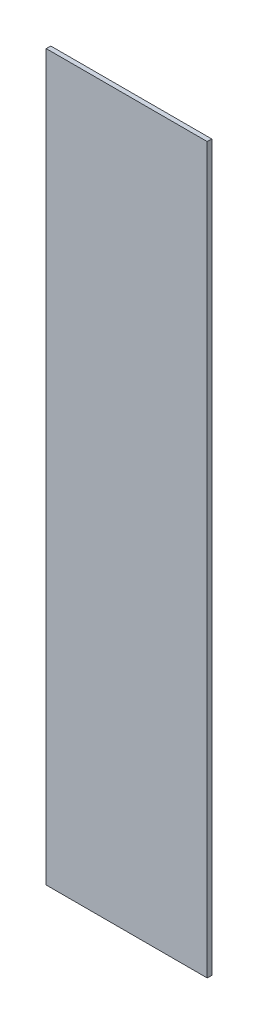
ISO-10303-21;
HEADER;
FILE_DESCRIPTION(('STEP AP214'),'2;1');
FILE_NAME('part.step','',(''),(''),'','','');
FILE_SCHEMA(('AUTOMOTIVE_DESIGN { 1 0 10303 214 1 1 1 1 }'));
ENDSEC;
DATA;
#1=APPLICATION_CONTEXT('core data for automotive mechanical design processes');
#2=APPLICATION_PROTOCOL_DEFINITION('international standard','automotive_design',2000,#1);
#3=PRODUCT_CONTEXT('',#1,'mechanical');
#4=PRODUCT('Part','Part','',(#3));
#5=PRODUCT_RELATED_PRODUCT_CATEGORY('part','',(#4));
#6=PRODUCT_DEFINITION_FORMATION('','',#4);
#7=PRODUCT_DEFINITION_CONTEXT('part definition',#1,'design');
#8=PRODUCT_DEFINITION('design','',#6,#7);
#9=PRODUCT_DEFINITION_SHAPE('','',#8);
#10=(LENGTH_UNIT() NAMED_UNIT(*) SI_UNIT(.MILLI.,.METRE.));
#11=(NAMED_UNIT(*) PLANE_ANGLE_UNIT() SI_UNIT($,.RADIAN.));
#12=(NAMED_UNIT(*) SI_UNIT($,.STERADIAN.) SOLID_ANGLE_UNIT());
#13=UNCERTAINTY_MEASURE_WITH_UNIT(LENGTH_MEASURE(1.E-05),#10,'distance_accuracy_value','');
#14=(GEOMETRIC_REPRESENTATION_CONTEXT(3) GLOBAL_UNCERTAINTY_ASSIGNED_CONTEXT((#13)) GLOBAL_UNIT_ASSIGNED_CONTEXT((#10,
#11,#12)) REPRESENTATION_CONTEXT('',''));
#15=CARTESIAN_POINT('',(0.,0.,0.));
#16=DIRECTION('',(0.,0.,1.));
#17=DIRECTION('',(1.,0.,0.));
#18=AXIS2_PLACEMENT_3D('',#15,#16,#17);
#19=CARTESIAN_POINT('',(-0.1778,0.8001,0.));
#20=DIRECTION('',(0.,0.,1.));
#21=DIRECTION('',(1.,0.,0.));
#22=AXIS2_PLACEMENT_3D('',#19,#20,#21);
#23=PLANE('',#22);
#24=DIRECTION('',(1.,0.,0.));
#25=VECTOR('',#24,1.);
#26=CARTESIAN_POINT('',(-0.1778,-0.8001,0.));
#27=LINE('',#26,#25);
#28=CARTESIAN_POINT('',(-0.1778,-0.8001,0.));
#29=VERTEX_POINT('',#28);
#30=CARTESIAN_POINT('',(0.1778,-0.8001,0.));
#31=VERTEX_POINT('',#30);
#32=EDGE_CURVE('E20',#29,#31,#27,.T.);
#33=ORIENTED_EDGE('',*,*,#32,.F.);
#34=DIRECTION('',(0.,1.,0.));
#35=VECTOR('',#34,1.);
#36=CARTESIAN_POINT('',(-0.1778,-0.8001,0.));
#37=LINE('',#36,#35);
#38=CARTESIAN_POINT('',(-0.1778,0.8001,0.));
#39=VERTEX_POINT('',#38);
#40=EDGE_CURVE('E69',#39,#29,#37,.F.);
#41=ORIENTED_EDGE('',*,*,#40,.F.);
#42=DIRECTION('',(1.,0.,0.));
#43=VECTOR('',#42,1.);
#44=CARTESIAN_POINT('',(-0.1778,0.8001,0.));
#45=LINE('',#44,#43);
#46=CARTESIAN_POINT('',(0.1778,0.8001,0.));
#47=VERTEX_POINT('',#46);
#48=EDGE_CURVE('E56',#47,#39,#45,.F.);
#49=ORIENTED_EDGE('',*,*,#48,.F.);
#50=DIRECTION('',(0.,1.,0.));
#51=VECTOR('',#50,1.);
#52=CARTESIAN_POINT('',(0.1778,0.8001,0.));
#53=LINE('',#52,#51);
#54=EDGE_CURVE('E62',#31,#47,#53,.T.);
#55=ORIENTED_EDGE('',*,*,#54,.F.);
#56=EDGE_LOOP('',(#33,#41,#49,#55));
#57=FACE_BOUND('',#56,.T.);
#58=ADVANCED_FACE('F17',(#57),#23,.F.);
#59=CARTESIAN_POINT('',(0.1778,0.8001,0.));
#60=DIRECTION('',(1.,0.,0.));
#61=DIRECTION('',(0.,0.,-1.));
#62=AXIS2_PLACEMENT_3D('',#59,#60,#61);
#63=PLANE('',#62);
#64=DIRECTION('',(0.,0.,1.));
#65=VECTOR('',#64,1.);
#66=CARTESIAN_POINT('',(0.1778,0.8001,0.));
#67=LINE('',#66,#65);
#68=CARTESIAN_POINT('',(0.1778,0.8001,0.01));
#69=VERTEX_POINT('',#68);
#70=EDGE_CURVE('E64',#69,#47,#67,.F.);
#71=ORIENTED_EDGE('',*,*,#70,.F.);
#72=DIRECTION('',(0.,1.,0.));
#73=VECTOR('',#72,1.);
#74=CARTESIAN_POINT('',(0.1778,0.8001,0.01));
#75=LINE('',#74,#73);
#76=CARTESIAN_POINT('',(0.1778,-0.8001,0.01));
#77=VERTEX_POINT('',#76);
#78=EDGE_CURVE('E83',#77,#69,#75,.T.);
#79=ORIENTED_EDGE('',*,*,#78,.F.);
#80=DIRECTION('',(0.,0.,-1.));
#81=VECTOR('',#80,1.);
#82=CARTESIAN_POINT('',(0.1778,-0.8001,0.));
#83=LINE('',#82,#81);
#84=EDGE_CURVE('E67',#31,#77,#83,.F.);
#85=ORIENTED_EDGE('',*,*,#84,.F.);
#86=ORIENTED_EDGE('',*,*,#54,.T.);
#87=EDGE_LOOP('',(#71,#79,#85,#86));
#88=FACE_BOUND('',#87,.T.);
#89=ADVANCED_FACE('F63',(#88),#63,.T.);
#90=CARTESIAN_POINT('',(-0.1778,0.8001,0.));
#91=DIRECTION('',(0.,1.,0.));
#92=DIRECTION('',(0.,0.,1.));
#93=AXIS2_PLACEMENT_3D('',#90,#91,#92);
#94=PLANE('',#93);
#95=DIRECTION('',(0.,0.,1.));
#96=VECTOR('',#95,1.);
#97=CARTESIAN_POINT('',(-0.1778,0.8001,0.));
#98=LINE('',#97,#96);
#99=CARTESIAN_POINT('',(-0.1778,0.8001,0.01));
#100=VERTEX_POINT('',#99);
#101=EDGE_CURVE('E71',#100,#39,#98,.F.);
#102=ORIENTED_EDGE('',*,*,#101,.F.);
#103=DIRECTION('',(1.,0.,0.));
#104=VECTOR('',#103,1.);
#105=CARTESIAN_POINT('',(-0.1778,0.8001,0.01));
#106=LINE('',#105,#104);
#107=EDGE_CURVE('E75',#69,#100,#106,.F.);
#108=ORIENTED_EDGE('',*,*,#107,.F.);
#109=ORIENTED_EDGE('',*,*,#70,.T.);
#110=ORIENTED_EDGE('',*,*,#48,.T.);
#111=EDGE_LOOP('',(#102,#108,#109,#110));
#112=FACE_BOUND('',#111,.T.);
#113=ADVANCED_FACE('F73',(#112),#94,.T.);
#114=CARTESIAN_POINT('',(-0.1778,-0.8001,0.));
#115=DIRECTION('',(-1.,0.,0.));
#116=DIRECTION('',(0.,0.,1.));
#117=AXIS2_PLACEMENT_3D('',#114,#115,#116);
#118=PLANE('',#117);
#119=DIRECTION('',(0.,0.,-1.));
#120=VECTOR('',#119,1.);
#121=CARTESIAN_POINT('',(-0.1778,-0.8001,0.));
#122=LINE('',#121,#120);
#123=CARTESIAN_POINT('',(-0.1778,-0.8001,0.01));
#124=VERTEX_POINT('',#123);
#125=EDGE_CURVE('E35',#124,#29,#122,.T.);
#126=ORIENTED_EDGE('',*,*,#125,.F.);
#127=DIRECTION('',(0.,1.,0.));
#128=VECTOR('',#127,1.);
#129=CARTESIAN_POINT('',(-0.1778,0.8001,0.01));
#130=LINE('',#129,#128);
#131=EDGE_CURVE('E26',#100,#124,#130,.F.);
#132=ORIENTED_EDGE('',*,*,#131,.F.);
#133=ORIENTED_EDGE('',*,*,#101,.T.);
#134=ORIENTED_EDGE('',*,*,#40,.T.);
#135=EDGE_LOOP('',(#126,#132,#133,#134));
#136=FACE_BOUND('',#135,.T.);
#137=ADVANCED_FACE('F89',(#136),#118,.T.);
#138=CARTESIAN_POINT('',(0.1778,-0.8001,0.));
#139=DIRECTION('',(0.,-1.,0.));
#140=DIRECTION('',(0.,0.,-1.));
#141=AXIS2_PLACEMENT_3D('',#138,#139,#140);
#142=PLANE('',#141);
#143=ORIENTED_EDGE('',*,*,#84,.T.);
#144=DIRECTION('',(1.,0.,0.));
#145=VECTOR('',#144,1.);
#146=CARTESIAN_POINT('',(-0.1778,-0.8001,0.01));
#147=LINE('',#146,#145);
#148=EDGE_CURVE('E11',#124,#77,#147,.T.);
#149=ORIENTED_EDGE('',*,*,#148,.F.);
#150=ORIENTED_EDGE('',*,*,#125,.T.);
#151=ORIENTED_EDGE('',*,*,#32,.T.);
#152=EDGE_LOOP('',(#143,#149,#150,#151));
#153=FACE_BOUND('',#152,.T.);
#154=ADVANCED_FACE('F91',(#153),#142,.T.);
#155=CARTESIAN_POINT('',(-0.1778,0.8001,0.01));
#156=DIRECTION('',(0.,0.,1.));
#157=DIRECTION('',(1.,0.,0.));
#158=AXIS2_PLACEMENT_3D('',#155,#156,#157);
#159=PLANE('',#158);
#160=ORIENTED_EDGE('',*,*,#131,.T.);
#161=ORIENTED_EDGE('',*,*,#148,.T.);
#162=ORIENTED_EDGE('',*,*,#78,.T.);
#163=ORIENTED_EDGE('',*,*,#107,.T.);
#164=EDGE_LOOP('',(#160,#161,#162,#163));
#165=FACE_BOUND('',#164,.T.);
#166=ADVANCED_FACE('F88',(#165),#159,.T.);
#167=CLOSED_SHELL('',(#58,#89,#113,#137,#154,#166));
#168=MANIFOLD_SOLID_BREP('B1',#167);
#169=ADVANCED_BREP_SHAPE_REPRESENTATION('',(#18,#168),#14);
#170=SHAPE_DEFINITION_REPRESENTATION(#9,#169);
ENDSEC;
END-ISO-10303-21;
